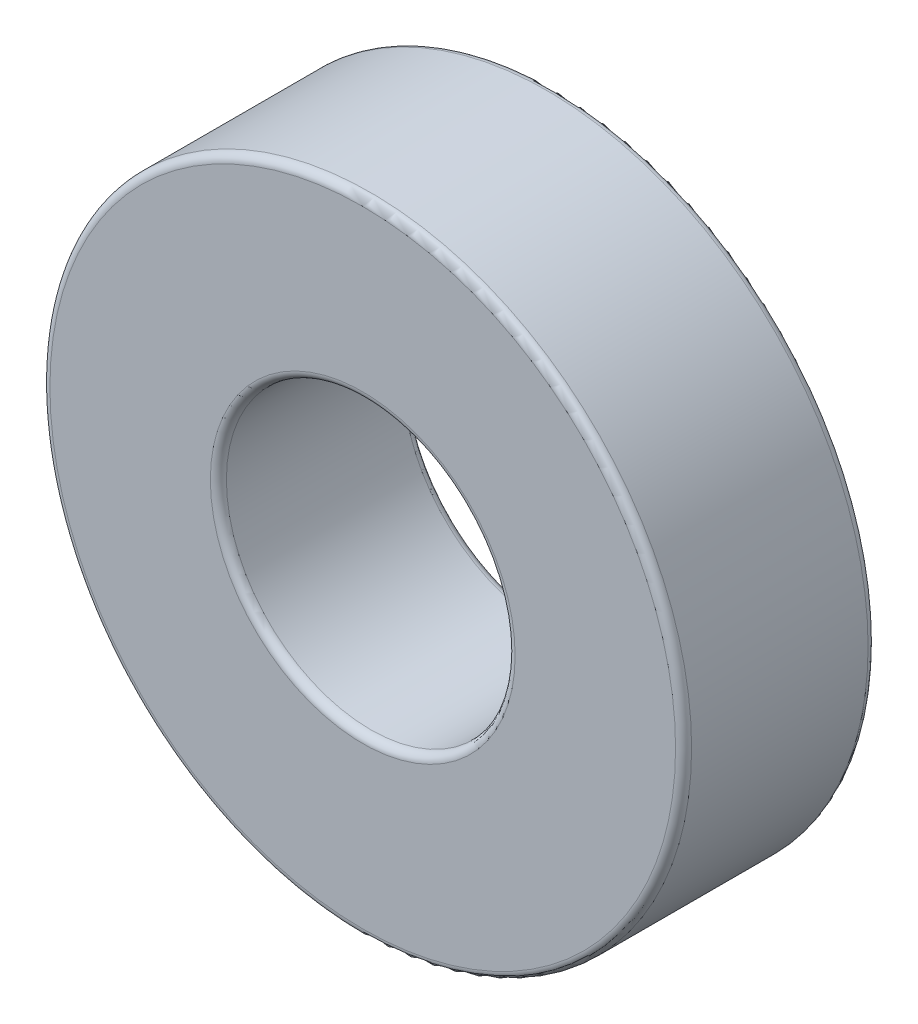
ISO-10303-21;
HEADER;
FILE_DESCRIPTION(('STEP AP214'),'2;1');
FILE_NAME('part.step','',(''),(''),'','','');
FILE_SCHEMA(('AUTOMOTIVE_DESIGN { 1 0 10303 214 1 1 1 1 }'));
ENDSEC;
DATA;
#1=APPLICATION_CONTEXT('core data for automotive mechanical design processes');
#2=APPLICATION_PROTOCOL_DEFINITION('international standard','automotive_design',2000,#1);
#3=PRODUCT_CONTEXT('',#1,'mechanical');
#4=PRODUCT('Part','Part','',(#3));
#5=PRODUCT_RELATED_PRODUCT_CATEGORY('part','',(#4));
#6=PRODUCT_DEFINITION_FORMATION('','',#4);
#7=PRODUCT_DEFINITION_CONTEXT('part definition',#1,'design');
#8=PRODUCT_DEFINITION('design','',#6,#7);
#9=PRODUCT_DEFINITION_SHAPE('','',#8);
#10=(LENGTH_UNIT() NAMED_UNIT(*) SI_UNIT(.MILLI.,.METRE.));
#11=(NAMED_UNIT(*) PLANE_ANGLE_UNIT() SI_UNIT($,.RADIAN.));
#12=(NAMED_UNIT(*) SI_UNIT($,.STERADIAN.) SOLID_ANGLE_UNIT());
#13=UNCERTAINTY_MEASURE_WITH_UNIT(LENGTH_MEASURE(1.E-05),#10,'distance_accuracy_value','');
#14=(GEOMETRIC_REPRESENTATION_CONTEXT(3) GLOBAL_UNCERTAINTY_ASSIGNED_CONTEXT((#13)) GLOBAL_UNIT_ASSIGNED_CONTEXT((#10,
#11,#12)) REPRESENTATION_CONTEXT('',''));
#15=CARTESIAN_POINT('',(0.,0.,0.));
#16=DIRECTION('',(0.,0.,1.));
#17=DIRECTION('',(1.,0.,0.));
#18=AXIS2_PLACEMENT_3D('',#15,#16,#17);
#19=CARTESIAN_POINT('',(0.,0.,12.));
#20=DIRECTION('',(0.,0.,-1.));
#21=DIRECTION('',(-1.,0.,0.));
#22=AXIS2_PLACEMENT_3D('',#19,#20,#21);
#23=CYLINDRICAL_SURFACE('',#22,20.);
#24=CARTESIAN_POINT('',(0.,0.,0.5));
#25=DIRECTION('',(0.,0.,1.));
#26=DIRECTION('',(1.,0.,0.));
#27=AXIS2_PLACEMENT_3D('',#24,#25,#26);
#28=CIRCLE('',#27,20.);
#29=CARTESIAN_POINT('',(20.,0.,0.5));
#30=VERTEX_POINT('',#29);
#31=EDGE_CURVE('E57',#30,#30,#28,.T.);
#32=ORIENTED_EDGE('',*,*,#31,.T.);
#33=EDGE_LOOP('',(#32));
#34=FACE_BOUND('',#33,.T.);
#35=CARTESIAN_POINT('',(0.,0.,11.5));
#36=DIRECTION('',(0.,0.,1.));
#37=DIRECTION('',(1.,0.,0.));
#38=AXIS2_PLACEMENT_3D('',#35,#36,#37);
#39=CIRCLE('',#38,20.);
#40=CARTESIAN_POINT('',(20.,0.,11.5));
#41=VERTEX_POINT('',#40);
#42=EDGE_CURVE('E60',#41,#41,#39,.F.);
#43=ORIENTED_EDGE('',*,*,#42,.T.);
#44=EDGE_LOOP('',(#43));
#45=FACE_BOUND('',#44,.T.);
#46=ADVANCED_FACE('F31',(#34,#45),#23,.T.);
#47=CARTESIAN_POINT('',(0.,0.,12.));
#48=DIRECTION('',(0.,0.,1.));
#49=DIRECTION('',(1.,0.,0.));
#50=AXIS2_PLACEMENT_3D('',#47,#48,#49);
#51=PLANE('',#50);
#52=CARTESIAN_POINT('',(0.,0.,12.));
#53=DIRECTION('',(0.,0.,1.));
#54=DIRECTION('',(1.,0.,0.));
#55=AXIS2_PLACEMENT_3D('',#52,#53,#54);
#56=CIRCLE('',#55,19.5);
#57=CARTESIAN_POINT('',(19.5,0.,12.));
#58=VERTEX_POINT('',#57);
#59=EDGE_CURVE('E42',#58,#58,#56,.T.);
#60=ORIENTED_EDGE('',*,*,#59,.T.);
#61=EDGE_LOOP('',(#60));
#62=FACE_BOUND('',#61,.T.);
#63=CARTESIAN_POINT('',(0.,0.,12.));
#64=DIRECTION('',(0.,0.,1.));
#65=DIRECTION('',(1.,0.,0.));
#66=AXIS2_PLACEMENT_3D('',#63,#64,#65);
#67=CIRCLE('',#66,9.5);
#68=CARTESIAN_POINT('',(9.5,0.,12.));
#69=VERTEX_POINT('',#68);
#70=EDGE_CURVE('E46',#69,#69,#67,.F.);
#71=ORIENTED_EDGE('',*,*,#70,.T.);
#72=EDGE_LOOP('',(#71));
#73=FACE_BOUND('',#72,.T.);
#74=ADVANCED_FACE('F73',(#62,#73),#51,.T.);
#75=CARTESIAN_POINT('',(0.,0.,0.));
#76=DIRECTION('',(0.,0.,1.));
#77=DIRECTION('',(1.,0.,0.));
#78=AXIS2_PLACEMENT_3D('',#75,#76,#77);
#79=PLANE('',#78);
#80=CARTESIAN_POINT('',(0.,0.,0.));
#81=DIRECTION('',(0.,0.,1.));
#82=DIRECTION('',(1.,0.,0.));
#83=AXIS2_PLACEMENT_3D('',#80,#81,#82);
#84=CIRCLE('',#83,19.5);
#85=CARTESIAN_POINT('',(19.5,0.,0.));
#86=VERTEX_POINT('',#85);
#87=EDGE_CURVE('E51',#86,#86,#84,.F.);
#88=ORIENTED_EDGE('',*,*,#87,.T.);
#89=EDGE_LOOP('',(#88));
#90=FACE_BOUND('',#89,.T.);
#91=CARTESIAN_POINT('',(0.,0.,0.));
#92=DIRECTION('',(0.,0.,1.));
#93=DIRECTION('',(1.,0.,0.));
#94=AXIS2_PLACEMENT_3D('',#91,#92,#93);
#95=CIRCLE('',#94,9.5);
#96=CARTESIAN_POINT('',(9.5,0.,0.));
#97=VERTEX_POINT('',#96);
#98=EDGE_CURVE('E54',#97,#97,#95,.T.);
#99=ORIENTED_EDGE('',*,*,#98,.T.);
#100=EDGE_LOOP('',(#99));
#101=FACE_BOUND('',#100,.T.);
#102=ADVANCED_FACE('F76',(#90,#101),#79,.F.);
#103=CARTESIAN_POINT('',(0.,0.,12.));
#104=DIRECTION('',(0.,0.,-1.));
#105=DIRECTION('',(-1.,0.,0.));
#106=AXIS2_PLACEMENT_3D('',#103,#104,#105);
#107=CYLINDRICAL_SURFACE('',#106,9.);
#108=CARTESIAN_POINT('',(0.,0.,11.5));
#109=DIRECTION('',(0.,0.,1.));
#110=DIRECTION('',(1.,0.,0.));
#111=AXIS2_PLACEMENT_3D('',#108,#109,#110);
#112=CIRCLE('',#111,9.);
#113=CARTESIAN_POINT('',(9.,0.,11.5));
#114=VERTEX_POINT('',#113);
#115=EDGE_CURVE('E10',#114,#114,#112,.T.);
#116=ORIENTED_EDGE('',*,*,#115,.T.);
#117=EDGE_LOOP('',(#116));
#118=FACE_BOUND('',#117,.T.);
#119=CARTESIAN_POINT('',(0.,0.,0.5));
#120=DIRECTION('',(0.,0.,1.));
#121=DIRECTION('',(1.,0.,0.));
#122=AXIS2_PLACEMENT_3D('',#119,#120,#121);
#123=CIRCLE('',#122,9.);
#124=CARTESIAN_POINT('',(9.,0.,0.5));
#125=VERTEX_POINT('',#124);
#126=EDGE_CURVE('E38',#125,#125,#123,.F.);
#127=ORIENTED_EDGE('',*,*,#126,.T.);
#128=EDGE_LOOP('',(#127));
#129=FACE_BOUND('',#128,.T.);
#130=ADVANCED_FACE('F94',(#118,#129),#107,.F.);
#131=CARTESIAN_POINT('',(0.,0.,0.5));
#132=DIRECTION('',(0.,0.,1.));
#133=DIRECTION('',(1.,0.,0.));
#134=AXIS2_PLACEMENT_3D('',#131,#132,#133);
#135=TOROIDAL_SURFACE('',#134,19.5,0.5);
#136=ORIENTED_EDGE('',*,*,#87,.F.);
#137=EDGE_LOOP('',(#136));
#138=FACE_BOUND('',#137,.T.);
#139=ORIENTED_EDGE('',*,*,#31,.F.);
#140=EDGE_LOOP('',(#139));
#141=FACE_BOUND('',#140,.T.);
#142=ADVANCED_FACE('F69',(#138,#141),#135,.T.);
#143=CARTESIAN_POINT('',(0.,0.,11.5));
#144=DIRECTION('',(0.,0.,1.));
#145=DIRECTION('',(1.,0.,0.));
#146=AXIS2_PLACEMENT_3D('',#143,#144,#145);
#147=TOROIDAL_SURFACE('',#146,19.5,0.5);
#148=ORIENTED_EDGE('',*,*,#42,.F.);
#149=EDGE_LOOP('',(#148));
#150=FACE_BOUND('',#149,.T.);
#151=ORIENTED_EDGE('',*,*,#59,.F.);
#152=EDGE_LOOP('',(#151));
#153=FACE_BOUND('',#152,.T.);
#154=ADVANCED_FACE('F65',(#150,#153),#147,.T.);
#155=CARTESIAN_POINT('',(0.,0.,11.5));
#156=DIRECTION('',(0.,0.,1.));
#157=DIRECTION('',(1.,0.,0.));
#158=AXIS2_PLACEMENT_3D('',#155,#156,#157);
#159=TOROIDAL_SURFACE('',#158,9.5,0.5);
#160=ORIENTED_EDGE('',*,*,#115,.F.);
#161=EDGE_LOOP('',(#160));
#162=FACE_BOUND('',#161,.T.);
#163=ORIENTED_EDGE('',*,*,#70,.F.);
#164=EDGE_LOOP('',(#163));
#165=FACE_BOUND('',#164,.T.);
#166=ADVANCED_FACE('F68',(#162,#165),#159,.T.);
#167=CARTESIAN_POINT('',(0.,0.,0.5));
#168=DIRECTION('',(0.,0.,1.));
#169=DIRECTION('',(1.,0.,0.));
#170=AXIS2_PLACEMENT_3D('',#167,#168,#169);
#171=TOROIDAL_SURFACE('',#170,9.5,0.5);
#172=ORIENTED_EDGE('',*,*,#98,.F.);
#173=EDGE_LOOP('',(#172));
#174=FACE_BOUND('',#173,.T.);
#175=ORIENTED_EDGE('',*,*,#126,.F.);
#176=EDGE_LOOP('',(#175));
#177=FACE_BOUND('',#176,.T.);
#178=ADVANCED_FACE('F33',(#174,#177),#171,.T.);
#179=CLOSED_SHELL('',(#46,#74,#102,#130,#142,#154,#166,#178));
#180=MANIFOLD_SOLID_BREP('B2',#179);
#181=ADVANCED_BREP_SHAPE_REPRESENTATION('',(#18,#180),#14);
#182=SHAPE_DEFINITION_REPRESENTATION(#9,#181);
ENDSEC;
END-ISO-10303-21;
